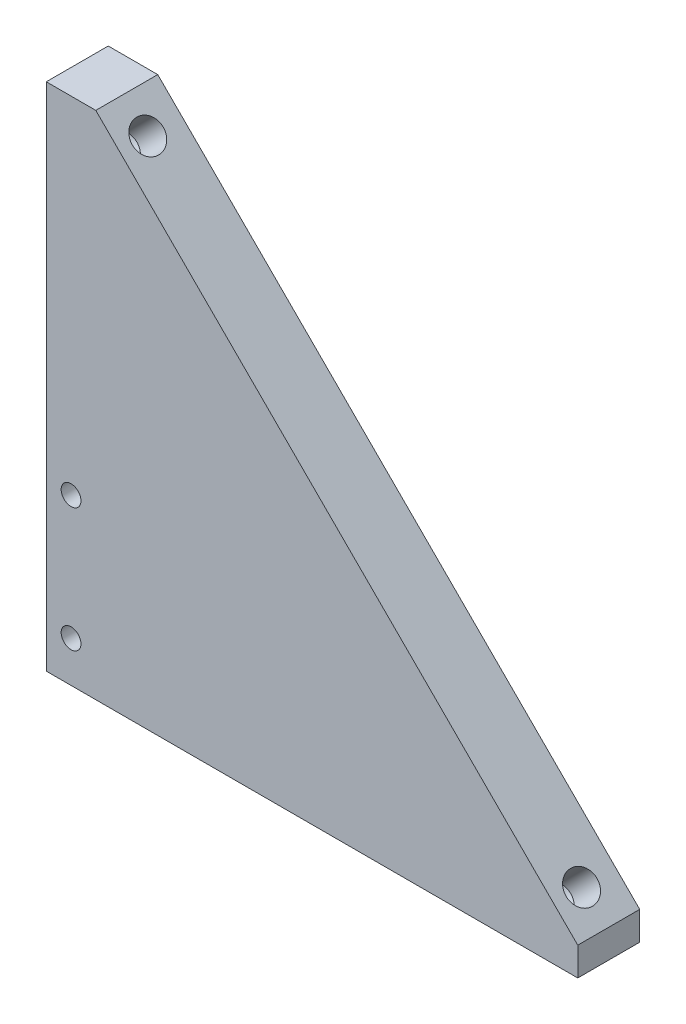
ISO-10303-21;
HEADER;
FILE_DESCRIPTION(('STEP AP214'),'2;1');
FILE_NAME('part.step','',(''),(''),'','','');
FILE_SCHEMA(('AUTOMOTIVE_DESIGN { 1 0 10303 214 1 1 1 1 }'));
ENDSEC;
DATA;
#1=APPLICATION_CONTEXT('core data for automotive mechanical design processes');
#2=APPLICATION_PROTOCOL_DEFINITION('international standard','automotive_design',2000,#1);
#3=PRODUCT_CONTEXT('',#1,'mechanical');
#4=PRODUCT('Part','Part','',(#3));
#5=PRODUCT_RELATED_PRODUCT_CATEGORY('part','',(#4));
#6=PRODUCT_DEFINITION_FORMATION('','',#4);
#7=PRODUCT_DEFINITION_CONTEXT('part definition',#1,'design');
#8=PRODUCT_DEFINITION('design','',#6,#7);
#9=PRODUCT_DEFINITION_SHAPE('','',#8);
#10=(LENGTH_UNIT() NAMED_UNIT(*) SI_UNIT(.MILLI.,.METRE.));
#11=(NAMED_UNIT(*) PLANE_ANGLE_UNIT() SI_UNIT($,.RADIAN.));
#12=(NAMED_UNIT(*) SI_UNIT($,.STERADIAN.) SOLID_ANGLE_UNIT());
#13=UNCERTAINTY_MEASURE_WITH_UNIT(LENGTH_MEASURE(1.E-05),#10,'distance_accuracy_value','');
#14=(GEOMETRIC_REPRESENTATION_CONTEXT(3) GLOBAL_UNCERTAINTY_ASSIGNED_CONTEXT((#13)) GLOBAL_UNIT_ASSIGNED_CONTEXT((#10,
#11,#12)) REPRESENTATION_CONTEXT('',''));
#15=CARTESIAN_POINT('',(0.,0.,0.));
#16=DIRECTION('',(0.,0.,1.));
#17=DIRECTION('',(1.,0.,0.));
#18=AXIS2_PLACEMENT_3D('',#15,#16,#17);
#19=CARTESIAN_POINT('',(-19.44543648263,19.4454364826301,5.));
#20=DIRECTION('',(-0.707106781186549,-0.707106781186546,0.));
#21=DIRECTION('',(0.707106781186546,-0.707106781186549,0.));
#22=AXIS2_PLACEMENT_3D('',#19,#20,#21);
#23=PLANE('',#22);
#24=CARTESIAN_POINT('',(-13.9653589284343,13.9653589284343,2.75));
#25=DIRECTION('',(0.707106781186549,0.707106781186546,0.));
#26=DIRECTION('',(-0.707106781186546,0.707106781186549,0.));
#27=AXIS2_PLACEMENT_3D('',#24,#25,#26);
#28=CIRCLE('',#27,1.24999999999999);
#29=CARTESIAN_POINT('',(-14.8492424049175,14.8492424049175,2.75));
#30=VERTEX_POINT('',#29);
#31=EDGE_CURVE('E157',#30,#30,#28,.T.);
#32=ORIENTED_EDGE('',*,*,#31,.F.);
#33=EDGE_LOOP('',(#32));
#34=FACE_BOUND('',#33,.T.);
#35=CARTESIAN_POINT('',(21.0364267402998,-21.0364267402998,2.75));
#36=DIRECTION('',(0.707106781186549,0.707106781186546,0.));
#37=DIRECTION('',(-0.707106781186546,0.707106781186549,0.));
#38=AXIS2_PLACEMENT_3D('',#35,#36,#37);
#39=CIRCLE('',#38,1.24999999999999);
#40=CARTESIAN_POINT('',(20.1525432638166,-20.1525432638166,2.75));
#41=VERTEX_POINT('',#40);
#42=EDGE_CURVE('E163',#41,#41,#39,.T.);
#43=ORIENTED_EDGE('',*,*,#42,.F.);
#44=EDGE_LOOP('',(#43));
#45=FACE_BOUND('',#44,.T.);
#46=DIRECTION('',(-0.707106781186546,0.707106781186549,0.));
#47=VECTOR('',#46,1.);
#48=CARTESIAN_POINT('',(-19.44543648263,19.4454364826301,5.));
#49=LINE('',#48,#47);
#50=CARTESIAN_POINT('',(22.9809703885627,-22.9809703885628,5.));
#51=VERTEX_POINT('',#50);
#52=CARTESIAN_POINT('',(-15.9099025766974,15.9099025766973,5.));
#53=VERTEX_POINT('',#52);
#54=EDGE_CURVE('E11',#51,#53,#49,.T.);
#55=ORIENTED_EDGE('',*,*,#54,.F.);
#56=DIRECTION('',(0.,0.,1.));
#57=VECTOR('',#56,1.);
#58=CARTESIAN_POINT('',(22.9809703885627,-22.9809703885628,0.));
#59=LINE('',#58,#57);
#60=CARTESIAN_POINT('',(22.9809703885627,-22.9809703885628,0.));
#61=VERTEX_POINT('',#60);
#62=EDGE_CURVE('E149',#61,#51,#59,.T.);
#63=ORIENTED_EDGE('',*,*,#62,.F.);
#64=DIRECTION('',(-0.707106781186546,0.707106781186549,0.));
#65=VECTOR('',#64,1.);
#66=CARTESIAN_POINT('',(-19.44543648263,19.4454364826301,0.));
#67=LINE('',#66,#65);
#68=CARTESIAN_POINT('',(-15.9099025766973,15.9099025766973,0.));
#69=VERTEX_POINT('',#68);
#70=EDGE_CURVE('E40',#61,#69,#67,.T.);
#71=ORIENTED_EDGE('',*,*,#70,.T.);
#72=DIRECTION('',(0.,0.,1.));
#73=VECTOR('',#72,1.);
#74=CARTESIAN_POINT('',(-15.9099025766974,15.9099025766973,0.));
#75=LINE('',#74,#73);
#76=EDGE_CURVE('E154',#69,#53,#75,.T.);
#77=ORIENTED_EDGE('',*,*,#76,.T.);
#78=EDGE_LOOP('',(#55,#63,#71,#77));
#79=FACE_BOUND('',#78,.T.);
#80=ADVANCED_FACE('F37',(#34,#45,#79),#23,.F.);
#81=CARTESIAN_POINT('',(0.,0.,5.));
#82=DIRECTION('',(0.,0.,-1.));
#83=DIRECTION('',(-1.,0.,0.));
#84=AXIS2_PLACEMENT_3D('',#81,#82,#83);
#85=PLANE('',#84);
#86=CARTESIAN_POINT('',(-17.90543648263,-11.9765042944956,5.));
#87=DIRECTION('',(0.,0.,-1.));
#88=DIRECTION('',(-1.,0.,0.));
#89=AXIS2_PLACEMENT_3D('',#86,#87,#88);
#90=CIRCLE('',#89,0.799999999999999);
#91=CARTESIAN_POINT('',(-18.70543648263,-11.9765042944956,5.));
#92=VERTEX_POINT('',#91);
#93=EDGE_CURVE('E122',#92,#92,#90,.T.);
#94=ORIENTED_EDGE('',*,*,#93,.T.);
#95=EDGE_LOOP('',(#94));
#96=FACE_BOUND('',#95,.T.);
#97=CARTESIAN_POINT('',(-17.90543648263,-21.9765042944956,5.));
#98=DIRECTION('',(0.,0.,-1.));
#99=DIRECTION('',(-1.,0.,0.));
#100=AXIS2_PLACEMENT_3D('',#97,#98,#99);
#101=CIRCLE('',#100,0.799999999999999);
#102=CARTESIAN_POINT('',(-18.70543648263,-21.9765042944956,5.));
#103=VERTEX_POINT('',#102);
#104=EDGE_CURVE('E128',#103,#103,#101,.T.);
#105=ORIENTED_EDGE('',*,*,#104,.T.);
#106=EDGE_LOOP('',(#105));
#107=FACE_BOUND('',#106,.T.);
#108=DIRECTION('',(0.,-1.,0.));
#109=VECTOR('',#108,1.);
#110=CARTESIAN_POINT('',(-19.90543648263,15.9099025766973,5.));
#111=LINE('',#110,#109);
#112=CARTESIAN_POINT('',(-19.90543648263,15.9099025766973,5.));
#113=VERTEX_POINT('',#112);
#114=CARTESIAN_POINT('',(-19.90543648263,-25.2765042944956,5.));
#115=VERTEX_POINT('',#114);
#116=EDGE_CURVE('E131',#113,#115,#111,.T.);
#117=ORIENTED_EDGE('',*,*,#116,.T.);
#118=DIRECTION('',(-1.,0.,0.));
#119=VECTOR('',#118,1.);
#120=CARTESIAN_POINT('',(22.9809703885627,-25.2765042944956,5.));
#121=LINE('',#120,#119);
#122=CARTESIAN_POINT('',(22.9809703885627,-25.2765042944956,5.));
#123=VERTEX_POINT('',#122);
#124=EDGE_CURVE('E51',#123,#115,#121,.T.);
#125=ORIENTED_EDGE('',*,*,#124,.F.);
#126=DIRECTION('',(0.,-1.,0.));
#127=VECTOR('',#126,1.);
#128=CARTESIAN_POINT('',(22.9809703885627,-26.5165042944956,5.));
#129=LINE('',#128,#127);
#130=EDGE_CURVE('E146',#51,#123,#129,.T.);
#131=ORIENTED_EDGE('',*,*,#130,.F.);
#132=ORIENTED_EDGE('',*,*,#54,.T.);
#133=DIRECTION('',(1.,0.,0.));
#134=VECTOR('',#133,1.);
#135=CARTESIAN_POINT('',(-19.44543648263,15.9099025766973,5.));
#136=LINE('',#135,#134);
#137=EDGE_CURVE('E141',#113,#53,#136,.T.);
#138=ORIENTED_EDGE('',*,*,#137,.F.);
#139=EDGE_LOOP('',(#117,#125,#131,#132,#138));
#140=FACE_BOUND('',#139,.T.);
#141=ADVANCED_FACE('F185',(#96,#107,#140),#85,.F.);
#142=CARTESIAN_POINT('',(0.,0.,0.));
#143=DIRECTION('',(0.,0.,-1.));
#144=DIRECTION('',(-1.,0.,0.));
#145=AXIS2_PLACEMENT_3D('',#142,#143,#144);
#146=PLANE('',#145);
#147=DIRECTION('',(-1.,0.,0.));
#148=VECTOR('',#147,1.);
#149=CARTESIAN_POINT('',(22.9809703885627,-25.2765042944956,0.));
#150=LINE('',#149,#148);
#151=CARTESIAN_POINT('',(22.9809703885627,-25.2765042944956,0.));
#152=VERTEX_POINT('',#151);
#153=CARTESIAN_POINT('',(-19.90543648263,-25.2765042944956,0.));
#154=VERTEX_POINT('',#153);
#155=EDGE_CURVE('E111',#152,#154,#150,.T.);
#156=ORIENTED_EDGE('',*,*,#155,.T.);
#157=DIRECTION('',(0.,-1.,0.));
#158=VECTOR('',#157,1.);
#159=CARTESIAN_POINT('',(-19.90543648263,15.9099025766973,0.));
#160=LINE('',#159,#158);
#161=CARTESIAN_POINT('',(-19.90543648263,15.9099025766973,0.));
#162=VERTEX_POINT('',#161);
#163=EDGE_CURVE('E132',#162,#154,#160,.T.);
#164=ORIENTED_EDGE('',*,*,#163,.F.);
#165=DIRECTION('',(1.,0.,0.));
#166=VECTOR('',#165,1.);
#167=CARTESIAN_POINT('',(-19.44543648263,15.9099025766973,0.));
#168=LINE('',#167,#166);
#169=EDGE_CURVE('E140',#162,#69,#168,.T.);
#170=ORIENTED_EDGE('',*,*,#169,.T.);
#171=ORIENTED_EDGE('',*,*,#70,.F.);
#172=DIRECTION('',(0.,-1.,0.));
#173=VECTOR('',#172,1.);
#174=CARTESIAN_POINT('',(22.9809703885627,-26.5165042944956,0.));
#175=LINE('',#174,#173);
#176=EDGE_CURVE('E143',#61,#152,#175,.T.);
#177=ORIENTED_EDGE('',*,*,#176,.T.);
#178=EDGE_LOOP('',(#156,#164,#170,#171,#177));
#179=FACE_BOUND('',#178,.T.);
#180=CARTESIAN_POINT('',(-17.90543648263,-11.9765042944956,0.));
#181=DIRECTION('',(0.,0.,-1.));
#182=DIRECTION('',(-1.,0.,0.));
#183=AXIS2_PLACEMENT_3D('',#180,#181,#182);
#184=CIRCLE('',#183,0.799999999999999);
#185=CARTESIAN_POINT('',(-18.70543648263,-11.9765042944956,0.));
#186=VERTEX_POINT('',#185);
#187=EDGE_CURVE('E118',#186,#186,#184,.T.);
#188=ORIENTED_EDGE('',*,*,#187,.F.);
#189=EDGE_LOOP('',(#188));
#190=FACE_BOUND('',#189,.T.);
#191=CARTESIAN_POINT('',(-17.90543648263,-21.9765042944956,0.));
#192=DIRECTION('',(0.,0.,-1.));
#193=DIRECTION('',(-1.,0.,0.));
#194=AXIS2_PLACEMENT_3D('',#191,#192,#193);
#195=CIRCLE('',#194,0.799999999999999);
#196=CARTESIAN_POINT('',(-18.70543648263,-21.9765042944956,0.));
#197=VERTEX_POINT('',#196);
#198=EDGE_CURVE('E125',#197,#197,#195,.T.);
#199=ORIENTED_EDGE('',*,*,#198,.F.);
#200=EDGE_LOOP('',(#199));
#201=FACE_BOUND('',#200,.T.);
#202=ADVANCED_FACE('F175',(#179,#190,#201),#146,.T.);
#203=CARTESIAN_POINT('',(18.9151063967401,-23.1577470838595,2.75));
#204=DIRECTION('',(0.707106781186549,0.707106781186546,0.));
#205=DIRECTION('',(-0.707106781186546,0.707106781186549,0.));
#206=AXIS2_PLACEMENT_3D('',#203,#204,#205);
#207=CONICAL_SURFACE('',#206,1.25,1.02974425867665);
#208=CARTESIAN_POINT('',(18.3840156239122,-23.6888378566874,2.75));
#209=VERTEX_POINT('',#208);
#210=VERTEX_LOOP('',#209);
#211=FACE_BOUND('',#210,.T.);
#212=CARTESIAN_POINT('',(18.9151063967401,-23.1577470838595,2.75));
#213=DIRECTION('',(0.707106781186549,0.707106781186546,0.));
#214=DIRECTION('',(-0.707106781186546,0.707106781186549,0.));
#215=AXIS2_PLACEMENT_3D('',#212,#213,#214);
#216=CIRCLE('',#215,1.25);
#217=CARTESIAN_POINT('',(18.0312229202569,-22.2738636073763,2.75));
#218=VERTEX_POINT('',#217);
#219=EDGE_CURVE('E166',#218,#218,#216,.T.);
#220=ORIENTED_EDGE('',*,*,#219,.T.);
#221=EDGE_LOOP('',(#220));
#222=FACE_BOUND('',#221,.T.);
#223=ADVANCED_FACE('F221',(#211,#222),#207,.F.);
#224=CARTESIAN_POINT('',(21.0364267402998,-21.0364267402998,2.75));
#225=DIRECTION('',(0.707106781186549,0.707106781186546,0.));
#226=DIRECTION('',(-0.707106781186546,0.707106781186549,0.));
#227=AXIS2_PLACEMENT_3D('',#224,#225,#226);
#228=CYLINDRICAL_SURFACE('',#227,1.24999999999999);
#229=ORIENTED_EDGE('',*,*,#219,.F.);
#230=EDGE_LOOP('',(#229));
#231=FACE_BOUND('',#230,.T.);
#232=ORIENTED_EDGE('',*,*,#42,.T.);
#233=EDGE_LOOP('',(#232));
#234=FACE_BOUND('',#233,.T.);
#235=ADVANCED_FACE('F218',(#231,#234),#228,.F.);
#236=CARTESIAN_POINT('',(-16.0866792719939,11.8440385848747,2.75));
#237=DIRECTION('',(0.707106781186549,0.707106781186546,0.));
#238=DIRECTION('',(-0.707106781186546,0.707106781186549,0.));
#239=AXIS2_PLACEMENT_3D('',#236,#237,#238);
#240=CONICAL_SURFACE('',#239,1.25,1.02974425867665);
#241=CARTESIAN_POINT('',(-16.6177700448219,11.3129478120468,2.75));
#242=VERTEX_POINT('',#241);
#243=VERTEX_LOOP('',#242);
#244=FACE_BOUND('',#243,.T.);
#245=CARTESIAN_POINT('',(-16.0866792719939,11.8440385848747,2.75));
#246=DIRECTION('',(0.707106781186549,0.707106781186546,0.));
#247=DIRECTION('',(-0.707106781186546,0.707106781186549,0.));
#248=AXIS2_PLACEMENT_3D('',#245,#246,#247);
#249=CIRCLE('',#248,1.25);
#250=CARTESIAN_POINT('',(-16.9705627484771,12.7279220613579,2.75));
#251=VERTEX_POINT('',#250);
#252=EDGE_CURVE('E160',#251,#251,#249,.T.);
#253=ORIENTED_EDGE('',*,*,#252,.T.);
#254=EDGE_LOOP('',(#253));
#255=FACE_BOUND('',#254,.T.);
#256=ADVANCED_FACE('F220',(#244,#255),#240,.F.);
#257=CARTESIAN_POINT('',(-13.9653589284343,13.9653589284343,2.75));
#258=DIRECTION('',(0.707106781186549,0.707106781186546,0.));
#259=DIRECTION('',(-0.707106781186546,0.707106781186549,0.));
#260=AXIS2_PLACEMENT_3D('',#257,#258,#259);
#261=CYLINDRICAL_SURFACE('',#260,1.24999999999999);
#262=ORIENTED_EDGE('',*,*,#252,.F.);
#263=EDGE_LOOP('',(#262));
#264=FACE_BOUND('',#263,.T.);
#265=ORIENTED_EDGE('',*,*,#31,.T.);
#266=EDGE_LOOP('',(#265));
#267=FACE_BOUND('',#266,.T.);
#268=ADVANCED_FACE('F228',(#264,#267),#261,.F.);
#269=CARTESIAN_POINT('',(22.9809703885627,-26.5165042944956,5.));
#270=DIRECTION('',(1.,0.,0.));
#271=DIRECTION('',(0.,0.,-1.));
#272=AXIS2_PLACEMENT_3D('',#269,#270,#271);
#273=PLANE('',#272);
#274=DIRECTION('',(0.,0.,1.));
#275=VECTOR('',#274,1.);
#276=CARTESIAN_POINT('',(22.9809703885627,-25.2765042944956,0.));
#277=LINE('',#276,#275);
#278=EDGE_CURVE('E114',#152,#123,#277,.T.);
#279=ORIENTED_EDGE('',*,*,#278,.F.);
#280=ORIENTED_EDGE('',*,*,#176,.F.);
#281=ORIENTED_EDGE('',*,*,#62,.T.);
#282=ORIENTED_EDGE('',*,*,#130,.T.);
#283=EDGE_LOOP('',(#279,#280,#281,#282));
#284=FACE_BOUND('',#283,.T.);
#285=ADVANCED_FACE('F189',(#284),#273,.T.);
#286=CARTESIAN_POINT('',(-19.44543648263,15.9099025766973,5.));
#287=DIRECTION('',(0.,1.,0.));
#288=DIRECTION('',(0.,0.,1.));
#289=AXIS2_PLACEMENT_3D('',#286,#287,#288);
#290=PLANE('',#289);
#291=ORIENTED_EDGE('',*,*,#169,.F.);
#292=DIRECTION('',(0.,0.,1.));
#293=VECTOR('',#292,1.);
#294=CARTESIAN_POINT('',(-19.90543648263,15.9099025766973,0.));
#295=LINE('',#294,#293);
#296=EDGE_CURVE('E135',#162,#113,#295,.T.);
#297=ORIENTED_EDGE('',*,*,#296,.T.);
#298=ORIENTED_EDGE('',*,*,#137,.T.);
#299=ORIENTED_EDGE('',*,*,#76,.F.);
#300=EDGE_LOOP('',(#291,#297,#298,#299));
#301=FACE_BOUND('',#300,.T.);
#302=ADVANCED_FACE('F180',(#301),#290,.T.);
#303=CARTESIAN_POINT('',(-19.90543648263,15.9099025766973,0.));
#304=DIRECTION('',(-1.,0.,0.));
#305=DIRECTION('',(0.,-1.,0.));
#306=AXIS2_PLACEMENT_3D('',#303,#304,#305);
#307=PLANE('',#306);
#308=DIRECTION('',(0.,0.,1.));
#309=VECTOR('',#308,1.);
#310=CARTESIAN_POINT('',(-19.90543648263,-25.2765042944956,0.));
#311=LINE('',#310,#309);
#312=EDGE_CURVE('E116',#154,#115,#311,.T.);
#313=ORIENTED_EDGE('',*,*,#312,.T.);
#314=ORIENTED_EDGE('',*,*,#116,.F.);
#315=ORIENTED_EDGE('',*,*,#296,.F.);
#316=ORIENTED_EDGE('',*,*,#163,.T.);
#317=EDGE_LOOP('',(#313,#314,#315,#316));
#318=FACE_BOUND('',#317,.T.);
#319=ADVANCED_FACE('F183',(#318),#307,.T.);
#320=CARTESIAN_POINT('',(-17.90543648263,-21.9765042944956,0.));
#321=DIRECTION('',(0.,0.,-1.));
#322=DIRECTION('',(-1.,0.,0.));
#323=AXIS2_PLACEMENT_3D('',#320,#321,#322);
#324=CYLINDRICAL_SURFACE('',#323,0.799999999999999);
#325=ORIENTED_EDGE('',*,*,#104,.F.);
#326=EDGE_LOOP('',(#325));
#327=FACE_BOUND('',#326,.T.);
#328=ORIENTED_EDGE('',*,*,#198,.T.);
#329=EDGE_LOOP('',(#328));
#330=FACE_BOUND('',#329,.T.);
#331=ADVANCED_FACE('F202',(#327,#330),#324,.F.);
#332=CARTESIAN_POINT('',(-17.90543648263,-11.9765042944956,0.));
#333=DIRECTION('',(0.,0.,-1.));
#334=DIRECTION('',(-1.,0.,0.));
#335=AXIS2_PLACEMENT_3D('',#332,#333,#334);
#336=CYLINDRICAL_SURFACE('',#335,0.799999999999999);
#337=ORIENTED_EDGE('',*,*,#93,.F.);
#338=EDGE_LOOP('',(#337));
#339=FACE_BOUND('',#338,.T.);
#340=ORIENTED_EDGE('',*,*,#187,.T.);
#341=EDGE_LOOP('',(#340));
#342=FACE_BOUND('',#341,.T.);
#343=ADVANCED_FACE('F193',(#339,#342),#336,.F.);
#344=CARTESIAN_POINT('',(22.9809703885627,-25.2765042944956,0.));
#345=DIRECTION('',(0.,1.,0.));
#346=DIRECTION('',(-1.,0.,0.));
#347=AXIS2_PLACEMENT_3D('',#344,#345,#346);
#348=PLANE('',#347);
#349=CARTESIAN_POINT('',(-7.90543648263003,-25.2765042944956,2.5));
#350=DIRECTION('',(0.,-1.,0.));
#351=DIRECTION('',(0.,0.,-1.));
#352=AXIS2_PLACEMENT_3D('',#349,#350,#351);
#353=CIRCLE('',#352,1.24999999999999);
#354=CARTESIAN_POINT('',(-7.90543648263003,-25.2765042944956,1.25000000000001));
#355=VERTEX_POINT('',#354);
#356=EDGE_CURVE('E101',#355,#355,#353,.T.);
#357=ORIENTED_EDGE('',*,*,#356,.F.);
#358=EDGE_LOOP('',(#357));
#359=FACE_BOUND('',#358,.T.);
#360=CARTESIAN_POINT('',(7.09456351736997,-25.2765042944956,2.5));
#361=DIRECTION('',(0.,-1.,0.));
#362=DIRECTION('',(0.,0.,-1.));
#363=AXIS2_PLACEMENT_3D('',#360,#361,#362);
#364=CIRCLE('',#363,1.24999999999999);
#365=CARTESIAN_POINT('',(7.09456351736997,-25.2765042944956,1.25000000000001));
#366=VERTEX_POINT('',#365);
#367=EDGE_CURVE('E100',#366,#366,#364,.T.);
#368=ORIENTED_EDGE('',*,*,#367,.F.);
#369=EDGE_LOOP('',(#368));
#370=FACE_BOUND('',#369,.T.);
#371=ORIENTED_EDGE('',*,*,#124,.T.);
#372=ORIENTED_EDGE('',*,*,#312,.F.);
#373=ORIENTED_EDGE('',*,*,#155,.F.);
#374=ORIENTED_EDGE('',*,*,#278,.T.);
#375=EDGE_LOOP('',(#371,#372,#373,#374));
#376=FACE_BOUND('',#375,.T.);
#377=ADVANCED_FACE('F190',(#359,#370,#376),#348,.F.);
#378=CARTESIAN_POINT('',(7.09456351736997,-19.2765042944956,2.5));
#379=DIRECTION('',(0.,-1.,0.));
#380=DIRECTION('',(0.,0.,-1.));
#381=AXIS2_PLACEMENT_3D('',#378,#379,#380);
#382=CONICAL_SURFACE('',#381,1.25,1.02974425867665);
#383=CARTESIAN_POINT('',(7.09456351736997,-18.5254285207111,2.5));
#384=VERTEX_POINT('',#383);
#385=VERTEX_LOOP('',#384);
#386=FACE_BOUND('',#385,.T.);
#387=CARTESIAN_POINT('',(7.09456351736997,-19.2765042944956,2.5));
#388=DIRECTION('',(0.,-1.,0.));
#389=DIRECTION('',(0.,0.,-1.));
#390=AXIS2_PLACEMENT_3D('',#387,#388,#389);
#391=CIRCLE('',#390,1.25);
#392=CARTESIAN_POINT('',(7.09456351736997,-19.2765042944956,1.25));
#393=VERTEX_POINT('',#392);
#394=EDGE_CURVE('E104',#393,#393,#391,.T.);
#395=ORIENTED_EDGE('',*,*,#394,.T.);
#396=EDGE_LOOP('',(#395));
#397=FACE_BOUND('',#396,.T.);
#398=ADVANCED_FACE('F192',(#386,#397),#382,.F.);
#399=CARTESIAN_POINT('',(7.09456351736997,-25.2765042944956,2.5));
#400=DIRECTION('',(0.,-1.,0.));
#401=DIRECTION('',(0.,0.,-1.));
#402=AXIS2_PLACEMENT_3D('',#399,#400,#401);
#403=CYLINDRICAL_SURFACE('',#402,1.24999999999999);
#404=ORIENTED_EDGE('',*,*,#394,.F.);
#405=EDGE_LOOP('',(#404));
#406=FACE_BOUND('',#405,.T.);
#407=ORIENTED_EDGE('',*,*,#367,.T.);
#408=EDGE_LOOP('',(#407));
#409=FACE_BOUND('',#408,.T.);
#410=ADVANCED_FACE('F94',(#406,#409),#403,.F.);
#411=CARTESIAN_POINT('',(-7.90543648263003,-19.2765042944956,2.5));
#412=DIRECTION('',(0.,-1.,0.));
#413=DIRECTION('',(0.,0.,-1.));
#414=AXIS2_PLACEMENT_3D('',#411,#412,#413);
#415=CONICAL_SURFACE('',#414,1.25,1.02974425867665);
#416=CARTESIAN_POINT('',(-7.90543648263003,-18.5254285207111,2.5));
#417=VERTEX_POINT('',#416);
#418=VERTEX_LOOP('',#417);
#419=FACE_BOUND('',#418,.T.);
#420=CARTESIAN_POINT('',(-7.90543648263003,-19.2765042944956,2.5));
#421=DIRECTION('',(0.,-1.,0.));
#422=DIRECTION('',(0.,0.,-1.));
#423=AXIS2_PLACEMENT_3D('',#420,#421,#422);
#424=CIRCLE('',#423,1.25);
#425=CARTESIAN_POINT('',(-7.90543648263003,-19.2765042944956,1.25));
#426=VERTEX_POINT('',#425);
#427=EDGE_CURVE('E98',#426,#426,#424,.T.);
#428=ORIENTED_EDGE('',*,*,#427,.T.);
#429=EDGE_LOOP('',(#428));
#430=FACE_BOUND('',#429,.T.);
#431=ADVANCED_FACE('F90',(#419,#430),#415,.F.);
#432=CARTESIAN_POINT('',(-7.90543648263003,-25.2765042944956,2.5));
#433=DIRECTION('',(0.,-1.,0.));
#434=DIRECTION('',(0.,0.,-1.));
#435=AXIS2_PLACEMENT_3D('',#432,#433,#434);
#436=CYLINDRICAL_SURFACE('',#435,1.24999999999999);
#437=ORIENTED_EDGE('',*,*,#427,.F.);
#438=EDGE_LOOP('',(#437));
#439=FACE_BOUND('',#438,.T.);
#440=ORIENTED_EDGE('',*,*,#356,.T.);
#441=EDGE_LOOP('',(#440));
#442=FACE_BOUND('',#441,.T.);
#443=ADVANCED_FACE('F93',(#439,#442),#436,.F.);
#444=CLOSED_SHELL('',(#80,#141,#202,#223,#235,#256,#268,#285,#302,#319,#331,#343,#377,#398,#410,
#431,#443));
#445=MANIFOLD_SOLID_BREP('B2',#444);
#446=ADVANCED_BREP_SHAPE_REPRESENTATION('',(#18,#445),#14);
#447=SHAPE_DEFINITION_REPRESENTATION(#9,#446);
ENDSEC;
END-ISO-10303-21;
